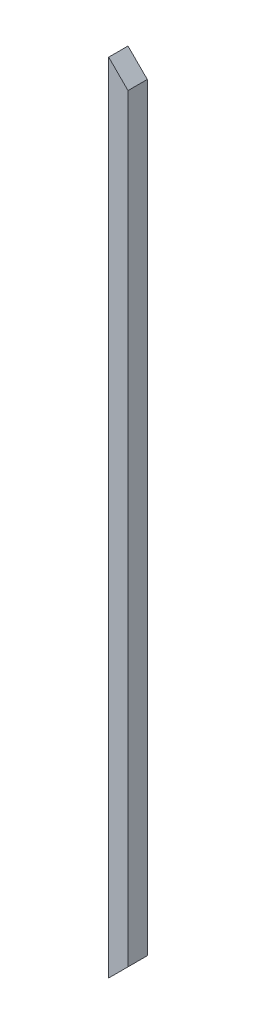
ISO-10303-21;
HEADER;
FILE_DESCRIPTION(('STEP AP214'),'2;1');
FILE_NAME('part.step','',(''),(''),'','','');
FILE_SCHEMA(('AUTOMOTIVE_DESIGN { 1 0 10303 214 1 1 1 1 }'));
ENDSEC;
DATA;
#1=APPLICATION_CONTEXT('core data for automotive mechanical design processes');
#2=APPLICATION_PROTOCOL_DEFINITION('international standard','automotive_design',2000,#1);
#3=PRODUCT_CONTEXT('',#1,'mechanical');
#4=PRODUCT('Part','Part','',(#3));
#5=PRODUCT_RELATED_PRODUCT_CATEGORY('part','',(#4));
#6=PRODUCT_DEFINITION_FORMATION('','',#4);
#7=PRODUCT_DEFINITION_CONTEXT('part definition',#1,'design');
#8=PRODUCT_DEFINITION('design','',#6,#7);
#9=PRODUCT_DEFINITION_SHAPE('','',#8);
#10=(LENGTH_UNIT() NAMED_UNIT(*) SI_UNIT(.MILLI.,.METRE.));
#11=(NAMED_UNIT(*) PLANE_ANGLE_UNIT() SI_UNIT($,.RADIAN.));
#12=(NAMED_UNIT(*) SI_UNIT($,.STERADIAN.) SOLID_ANGLE_UNIT());
#13=UNCERTAINTY_MEASURE_WITH_UNIT(LENGTH_MEASURE(1.E-05),#10,'distance_accuracy_value','');
#14=(GEOMETRIC_REPRESENTATION_CONTEXT(3) GLOBAL_UNCERTAINTY_ASSIGNED_CONTEXT((#13)) GLOBAL_UNIT_ASSIGNED_CONTEXT((#10,
#11,#12)) REPRESENTATION_CONTEXT('',''));
#15=CARTESIAN_POINT('',(0.,0.,0.));
#16=DIRECTION('',(0.,0.,1.));
#17=DIRECTION('',(1.,0.,0.));
#18=AXIS2_PLACEMENT_3D('',#15,#16,#17);
#19=CARTESIAN_POINT('',(9.525,787.4,9.525));
#20=DIRECTION('',(-1.,0.,0.));
#21=DIRECTION('',(0.,0.,1.));
#22=AXIS2_PLACEMENT_3D('',#19,#20,#21);
#23=PLANE('',#22);
#24=DIRECTION('',(0.,-1.,0.));
#25=VECTOR('',#24,1.);
#26=CARTESIAN_POINT('',(9.525,787.4,-9.525));
#27=LINE('',#26,#25);
#28=CARTESIAN_POINT('',(9.525,768.35,-9.525));
#29=VERTEX_POINT('',#28);
#30=CARTESIAN_POINT('',(9.525,19.0500000000003,-9.525));
#31=VERTEX_POINT('',#30);
#32=EDGE_CURVE('E11',#29,#31,#27,.T.);
#33=ORIENTED_EDGE('',*,*,#32,.F.);
#34=DIRECTION('',(0.,0.,-1.));
#35=VECTOR('',#34,1.);
#36=CARTESIAN_POINT('',(9.525,768.35,9.525));
#37=LINE('',#36,#35);
#38=CARTESIAN_POINT('',(9.525,768.35,9.525));
#39=VERTEX_POINT('',#38);
#40=EDGE_CURVE('E76',#39,#29,#37,.T.);
#41=ORIENTED_EDGE('',*,*,#40,.F.);
#42=DIRECTION('',(0.,-1.,0.));
#43=VECTOR('',#42,1.);
#44=CARTESIAN_POINT('',(9.525,787.4,9.525));
#45=LINE('',#44,#43);
#46=CARTESIAN_POINT('',(9.525,19.0500000000003,9.525));
#47=VERTEX_POINT('',#46);
#48=EDGE_CURVE('E88',#39,#47,#45,.T.);
#49=ORIENTED_EDGE('',*,*,#48,.T.);
#50=DIRECTION('',(0.,0.,-1.));
#51=VECTOR('',#50,1.);
#52=CARTESIAN_POINT('',(9.525,19.0500000000003,9.525));
#53=LINE('',#52,#51);
#54=EDGE_CURVE('E110',#47,#31,#53,.T.);
#55=ORIENTED_EDGE('',*,*,#54,.T.);
#56=EDGE_LOOP('',(#33,#41,#49,#55));
#57=FACE_BOUND('',#56,.T.);
#58=ADVANCED_FACE('F39',(#57),#23,.F.);
#59=CARTESIAN_POINT('',(-9.52500000000001,787.4,-9.525));
#60=DIRECTION('',(0.,0.,1.));
#61=DIRECTION('',(1.,0.,0.));
#62=AXIS2_PLACEMENT_3D('',#59,#60,#61);
#63=PLANE('',#62);
#64=DIRECTION('',(0.,-1.,0.));
#65=VECTOR('',#64,1.);
#66=CARTESIAN_POINT('',(-9.52500000000001,787.4,-9.525));
#67=LINE('',#66,#65);
#68=CARTESIAN_POINT('',(-9.52500000000001,787.4,-9.525));
#69=VERTEX_POINT('',#68);
#70=CARTESIAN_POINT('',(-9.52500000000001,0.,-9.525));
#71=VERTEX_POINT('',#70);
#72=EDGE_CURVE('E47',#69,#71,#67,.T.);
#73=ORIENTED_EDGE('',*,*,#72,.F.);
#74=DIRECTION('',(-0.707106781186541,0.707106781186554,0.));
#75=VECTOR('',#74,1.);
#76=CARTESIAN_POINT('',(-9.52500000000001,787.4,-9.525));
#77=LINE('',#76,#75);
#78=EDGE_CURVE('E53',#29,#69,#77,.T.);
#79=ORIENTED_EDGE('',*,*,#78,.F.);
#80=ORIENTED_EDGE('',*,*,#32,.T.);
#81=DIRECTION('',(0.707106781186541,0.707106781186554,0.));
#82=VECTOR('',#81,1.);
#83=CARTESIAN_POINT('',(-9.52500000000001,0.,-9.525));
#84=LINE('',#83,#82);
#85=EDGE_CURVE('E106',#71,#31,#84,.T.);
#86=ORIENTED_EDGE('',*,*,#85,.F.);
#87=EDGE_LOOP('',(#73,#79,#80,#86));
#88=FACE_BOUND('',#87,.T.);
#89=ADVANCED_FACE('F105',(#88),#63,.F.);
#90=CARTESIAN_POINT('',(-9.52500000000001,787.4,9.525));
#91=DIRECTION('',(1.,0.,0.));
#92=DIRECTION('',(0.,0.,-1.));
#93=AXIS2_PLACEMENT_3D('',#90,#91,#92);
#94=PLANE('',#93);
#95=DIRECTION('',(0.,0.,1.));
#96=VECTOR('',#95,1.);
#97=CARTESIAN_POINT('',(-9.52500000000001,0.,9.525));
#98=LINE('',#97,#96);
#99=CARTESIAN_POINT('',(-9.52500000000001,0.,9.525));
#100=VERTEX_POINT('',#99);
#101=EDGE_CURVE('E89',#71,#100,#98,.T.);
#102=ORIENTED_EDGE('',*,*,#101,.T.);
#103=DIRECTION('',(0.,-1.,0.));
#104=VECTOR('',#103,1.);
#105=CARTESIAN_POINT('',(-9.52500000000001,787.4,9.525));
#106=LINE('',#105,#104);
#107=CARTESIAN_POINT('',(-9.52500000000001,787.4,9.525));
#108=VERTEX_POINT('',#107);
#109=EDGE_CURVE('E94',#108,#100,#106,.T.);
#110=ORIENTED_EDGE('',*,*,#109,.F.);
#111=DIRECTION('',(0.,0.,1.));
#112=VECTOR('',#111,1.);
#113=CARTESIAN_POINT('',(-9.52500000000001,787.4,9.525));
#114=LINE('',#113,#112);
#115=EDGE_CURVE('E78',#69,#108,#114,.T.);
#116=ORIENTED_EDGE('',*,*,#115,.F.);
#117=ORIENTED_EDGE('',*,*,#72,.T.);
#118=EDGE_LOOP('',(#102,#110,#116,#117));
#119=FACE_BOUND('',#118,.T.);
#120=ADVANCED_FACE('F102',(#119),#94,.F.);
#121=CARTESIAN_POINT('',(-9.52500000000001,787.4,9.525));
#122=DIRECTION('',(0.,0.,-1.));
#123=DIRECTION('',(-1.,0.,0.));
#124=AXIS2_PLACEMENT_3D('',#121,#122,#123);
#125=PLANE('',#124);
#126=ORIENTED_EDGE('',*,*,#48,.F.);
#127=DIRECTION('',(-0.707106781186541,0.707106781186554,0.));
#128=VECTOR('',#127,1.);
#129=CARTESIAN_POINT('',(-9.52500000000001,787.4,9.525));
#130=LINE('',#129,#128);
#131=EDGE_CURVE('E73',#39,#108,#130,.T.);
#132=ORIENTED_EDGE('',*,*,#131,.T.);
#133=ORIENTED_EDGE('',*,*,#109,.T.);
#134=DIRECTION('',(0.707106781186541,0.707106781186554,0.));
#135=VECTOR('',#134,1.);
#136=CARTESIAN_POINT('',(-9.52500000000001,0.,9.525));
#137=LINE('',#136,#135);
#138=EDGE_CURVE('E93',#100,#47,#137,.T.);
#139=ORIENTED_EDGE('',*,*,#138,.T.);
#140=EDGE_LOOP('',(#126,#132,#133,#139));
#141=FACE_BOUND('',#140,.T.);
#142=ADVANCED_FACE('F92',(#141),#125,.F.);
#143=CARTESIAN_POINT('',(-9.52500000000001,0.,9.525));
#144=DIRECTION('',(-0.707106781186554,0.707106781186541,0.));
#145=DIRECTION('',(-0.707106781186541,-0.707106781186554,0.));
#146=AXIS2_PLACEMENT_3D('',#143,#144,#145);
#147=PLANE('',#146);
#148=ORIENTED_EDGE('',*,*,#85,.T.);
#149=ORIENTED_EDGE('',*,*,#54,.F.);
#150=ORIENTED_EDGE('',*,*,#138,.F.);
#151=ORIENTED_EDGE('',*,*,#101,.F.);
#152=EDGE_LOOP('',(#148,#149,#150,#151));
#153=FACE_BOUND('',#152,.T.);
#154=ADVANCED_FACE('F113',(#153),#147,.F.);
#155=CARTESIAN_POINT('',(-9.52500000000001,787.4,9.525));
#156=DIRECTION('',(-0.707106781186554,-0.707106781186541,0.));
#157=DIRECTION('',(0.707106781186541,-0.707106781186554,0.));
#158=AXIS2_PLACEMENT_3D('',#155,#156,#157);
#159=PLANE('',#158);
#160=ORIENTED_EDGE('',*,*,#78,.T.);
#161=ORIENTED_EDGE('',*,*,#115,.T.);
#162=ORIENTED_EDGE('',*,*,#131,.F.);
#163=ORIENTED_EDGE('',*,*,#40,.T.);
#164=EDGE_LOOP('',(#160,#161,#162,#163));
#165=FACE_BOUND('',#164,.T.);
#166=ADVANCED_FACE('F75',(#165),#159,.F.);
#167=CLOSED_SHELL('',(#58,#89,#120,#142,#154,#166));
#168=MANIFOLD_SOLID_BREP('B2',#167);
#169=ADVANCED_BREP_SHAPE_REPRESENTATION('',(#18,#168),#14);
#170=SHAPE_DEFINITION_REPRESENTATION(#9,#169);
ENDSEC;
END-ISO-10303-21;
